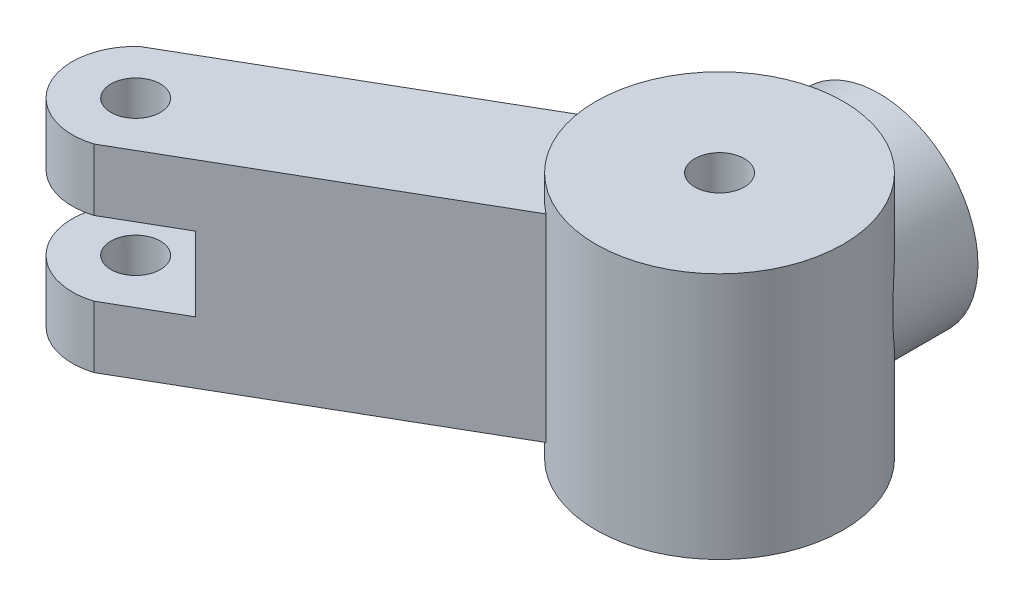
ISO-10303-21;
HEADER;
FILE_DESCRIPTION(('STEP AP214'),'2;1');
FILE_NAME('part.step','',(''),(''),'','','');
FILE_SCHEMA(('AUTOMOTIVE_DESIGN { 1 0 10303 214 1 1 1 1 }'));
ENDSEC;
DATA;
#1=APPLICATION_CONTEXT('core data for automotive mechanical design processes');
#2=APPLICATION_PROTOCOL_DEFINITION('international standard','automotive_design',2000,#1);
#3=PRODUCT_CONTEXT('',#1,'mechanical');
#4=PRODUCT('Part','Part','',(#3));
#5=PRODUCT_RELATED_PRODUCT_CATEGORY('part','',(#4));
#6=PRODUCT_DEFINITION_FORMATION('','',#4);
#7=PRODUCT_DEFINITION_CONTEXT('part definition',#1,'design');
#8=PRODUCT_DEFINITION('design','',#6,#7);
#9=PRODUCT_DEFINITION_SHAPE('','',#8);
#10=(LENGTH_UNIT() NAMED_UNIT(*) SI_UNIT(.MILLI.,.METRE.));
#11=(NAMED_UNIT(*) PLANE_ANGLE_UNIT() SI_UNIT($,.RADIAN.));
#12=(NAMED_UNIT(*) SI_UNIT($,.STERADIAN.) SOLID_ANGLE_UNIT());
#13=UNCERTAINTY_MEASURE_WITH_UNIT(LENGTH_MEASURE(1.E-05),#10,'distance_accuracy_value','');
#14=(GEOMETRIC_REPRESENTATION_CONTEXT(3) GLOBAL_UNCERTAINTY_ASSIGNED_CONTEXT((#13)) GLOBAL_UNIT_ASSIGNED_CONTEXT((#10,
#11,#12)) REPRESENTATION_CONTEXT('',''));
#15=CARTESIAN_POINT('',(0.,0.,0.));
#16=DIRECTION('',(0.,0.,1.));
#17=DIRECTION('',(1.,0.,0.));
#18=AXIS2_PLACEMENT_3D('',#15,#16,#17);
#19=CARTESIAN_POINT('',(-18.8789432215705,3.4417709979174,13.7450624126102));
#20=DIRECTION('',(0.,-1.,0.));
#21=DIRECTION('',(0.,0.,-1.));
#22=AXIS2_PLACEMENT_3D('',#19,#20,#21);
#23=PLANE('',#22);
#24=CARTESIAN_POINT('',(-15.4097531243728,3.4417709979174,14.6288759220713));
#25=DIRECTION('',(0.,1.,0.));
#26=DIRECTION('',(0.,0.,1.));
#27=AXIS2_PLACEMENT_3D('',#24,#25,#26);
#28=CIRCLE('',#27,0.999999999999999);
#29=CARTESIAN_POINT('',(-15.4097531243728,3.4417709979174,15.6288759220713));
#30=VERTEX_POINT('',#29);
#31=EDGE_CURVE('E302',#30,#30,#28,.T.);
#32=ORIENTED_EDGE('',*,*,#31,.F.);
#33=EDGE_LOOP('',(#32));
#34=FACE_BOUND('',#33,.T.);
#35=CARTESIAN_POINT('',(-15.4097531243728,3.4417709979174,14.6288759220713));
#36=DIRECTION('',(0.,1.,0.));
#37=DIRECTION('',(0.,0.,1.));
#38=AXIS2_PLACEMENT_3D('',#35,#36,#37);
#39=CIRCLE('',#38,2.5625);
#40=CARTESIAN_POINT('',(-17.1468924140016,3.4417709979174,12.7450624126102));
#41=VERTEX_POINT('',#40);
#42=CARTESIAN_POINT('',(-14.6468924140016,3.4417709979174,17.0751894315324));
#43=VERTEX_POINT('',#42);
#44=EDGE_CURVE('E128',#41,#43,#39,.T.);
#45=ORIENTED_EDGE('',*,*,#44,.T.);
#46=DIRECTION('',(0.866025403784436,0.,-0.500000000000004));
#47=VECTOR('',#46,1.);
#48=CARTESIAN_POINT('',(-16.3789432215705,3.4417709979174,18.0751894315324));
#49=LINE('',#48,#47);
#50=CARTESIAN_POINT('',(-3.06971510076741,3.4417709979174,10.3911029932806));
#51=VERTEX_POINT('',#50);
#52=EDGE_CURVE('E132',#43,#51,#49,.T.);
#53=ORIENTED_EDGE('',*,*,#52,.T.);
#54=CARTESIAN_POINT('',(0.,3.4417709979174,6.44435126557833));
#55=DIRECTION('',(0.,1.,0.));
#56=DIRECTION('',(0.,0.,1.));
#57=AXIS2_PLACEMENT_3D('',#54,#55,#56);
#58=CIRCLE('',#57,5.);
#59=CARTESIAN_POINT('',(-4.94426439264563,3.4417709979174,5.69987183965941));
#60=VERTEX_POINT('',#59);
#61=EDGE_CURVE('E157',#60,#51,#58,.T.);
#62=ORIENTED_EDGE('',*,*,#61,.F.);
#63=DIRECTION('',(0.866025403784436,0.,-0.500000000000004));
#64=VECTOR('',#63,1.);
#65=CARTESIAN_POINT('',(-18.8789432215705,3.4417709979174,13.7450624126102));
#66=LINE('',#65,#64);
#67=EDGE_CURVE('E133',#41,#60,#66,.T.);
#68=ORIENTED_EDGE('',*,*,#67,.F.);
#69=EDGE_LOOP('',(#45,#53,#62,#68));
#70=FACE_BOUND('',#69,.T.);
#71=ADVANCED_FACE('F59',(#34,#70),#23,.F.);
#72=CARTESIAN_POINT('',(-18.8789432215705,-4.5582290020826,13.7450624126102));
#73=DIRECTION('',(0.,1.,0.));
#74=DIRECTION('',(0.,0.,1.));
#75=AXIS2_PLACEMENT_3D('',#72,#73,#74);
#76=PLANE('',#75);
#77=CARTESIAN_POINT('',(-15.4097531243728,-4.5582290020826,14.6288759220713));
#78=DIRECTION('',(0.,1.,0.));
#79=DIRECTION('',(0.,0.,1.));
#80=AXIS2_PLACEMENT_3D('',#77,#78,#79);
#81=CIRCLE('',#80,0.999999999999999);
#82=CARTESIAN_POINT('',(-15.4097531243728,-4.5582290020826,15.6288759220713));
#83=VERTEX_POINT('',#82);
#84=EDGE_CURVE('E135',#83,#83,#81,.T.);
#85=ORIENTED_EDGE('',*,*,#84,.T.);
#86=EDGE_LOOP('',(#85));
#87=FACE_BOUND('',#86,.T.);
#88=DIRECTION('',(0.866025403784436,0.,-0.500000000000004));
#89=VECTOR('',#88,1.);
#90=CARTESIAN_POINT('',(-16.3789432215705,-4.5582290020826,18.0751894315324));
#91=LINE('',#90,#89);
#92=CARTESIAN_POINT('',(-14.6468924140016,-4.5582290020826,17.0751894315324));
#93=VERTEX_POINT('',#92);
#94=CARTESIAN_POINT('',(-3.06971510076741,-4.5582290020826,10.3911029932806));
#95=VERTEX_POINT('',#94);
#96=EDGE_CURVE('E85',#93,#95,#91,.T.);
#97=ORIENTED_EDGE('',*,*,#96,.F.);
#98=CARTESIAN_POINT('',(-15.4097531243728,-4.5582290020826,14.6288759220713));
#99=DIRECTION('',(0.,1.,0.));
#100=DIRECTION('',(0.,0.,1.));
#101=AXIS2_PLACEMENT_3D('',#98,#99,#100);
#102=CIRCLE('',#101,2.5625);
#103=CARTESIAN_POINT('',(-17.1468924140016,-4.5582290020826,12.7450624126102));
#104=VERTEX_POINT('',#103);
#105=EDGE_CURVE('E286',#104,#93,#102,.T.);
#106=ORIENTED_EDGE('',*,*,#105,.F.);
#107=DIRECTION('',(0.866025403784436,0.,-0.500000000000004));
#108=VECTOR('',#107,1.);
#109=CARTESIAN_POINT('',(-18.8789432215705,-4.5582290020826,13.7450624126102));
#110=LINE('',#109,#108);
#111=CARTESIAN_POINT('',(-4.94426439264563,-4.5582290020826,5.69987183965941));
#112=VERTEX_POINT('',#111);
#113=EDGE_CURVE('E151',#104,#112,#110,.T.);
#114=ORIENTED_EDGE('',*,*,#113,.T.);
#115=CARTESIAN_POINT('',(0.,-4.5582290020826,6.44435126557833));
#116=DIRECTION('',(0.,-1.,0.));
#117=DIRECTION('',(0.,0.,-1.));
#118=AXIS2_PLACEMENT_3D('',#115,#116,#117);
#119=CIRCLE('',#118,5.);
#120=EDGE_CURVE('E154',#95,#112,#119,.T.);
#121=ORIENTED_EDGE('',*,*,#120,.F.);
#122=EDGE_LOOP('',(#97,#106,#114,#121));
#123=FACE_BOUND('',#122,.T.);
#124=ADVANCED_FACE('F217',(#87,#123),#76,.F.);
#125=CARTESIAN_POINT('',(-8.8789432215704,-2.0582290020826,31.065570488299));
#126=DIRECTION('',(0.,-1.,0.));
#127=DIRECTION('',(0.,0.,-1.));
#128=AXIS2_PLACEMENT_3D('',#125,#126,#127);
#129=PLANE('',#128);
#130=CARTESIAN_POINT('',(-15.4097531243728,-2.0582290020826,14.6288759220713));
#131=DIRECTION('',(0.,-1.,0.));
#132=DIRECTION('',(0.,0.,-1.));
#133=AXIS2_PLACEMENT_3D('',#130,#131,#132);
#134=CIRCLE('',#133,0.999999999999999);
#135=CARTESIAN_POINT('',(-15.4097531243728,-2.0582290020826,13.6288759220713));
#136=VERTEX_POINT('',#135);
#137=EDGE_CURVE('E298',#136,#136,#134,.T.);
#138=ORIENTED_EDGE('',*,*,#137,.T.);
#139=EDGE_LOOP('',(#138));
#140=FACE_BOUND('',#139,.T.);
#141=CARTESIAN_POINT('',(-15.4097531243728,-2.0582290020826,14.6288759220713));
#142=DIRECTION('',(0.,-1.,0.));
#143=DIRECTION('',(0.,0.,-1.));
#144=AXIS2_PLACEMENT_3D('',#141,#142,#143);
#145=CIRCLE('',#144,2.5625);
#146=CARTESIAN_POINT('',(-14.6468924140016,-2.0582290020826,17.0751894315324));
#147=VERTEX_POINT('',#146);
#148=CARTESIAN_POINT('',(-17.1468924140016,-2.0582290020826,12.7450624126102));
#149=VERTEX_POINT('',#148);
#150=EDGE_CURVE('E289',#147,#149,#145,.T.);
#151=ORIENTED_EDGE('',*,*,#150,.F.);
#152=DIRECTION('',(-0.866025403784436,0.,0.500000000000004));
#153=VECTOR('',#152,1.);
#154=CARTESIAN_POINT('',(-16.3789432215705,-2.0582290020826,18.0751894315324));
#155=LINE('',#154,#153);
#156=CARTESIAN_POINT('',(-12.0488162026483,-2.0582290020826,15.5751894315324));
#157=VERTEX_POINT('',#156);
#158=EDGE_CURVE('E259',#157,#147,#155,.T.);
#159=ORIENTED_EDGE('',*,*,#158,.F.);
#160=DIRECTION('',(-0.500000000000004,0.,-0.866025403784436));
#161=VECTOR('',#160,1.);
#162=CARTESIAN_POINT('',(-4.54881620264821,-2.0582290020826,28.5655704882989));
#163=LINE('',#162,#161);
#164=CARTESIAN_POINT('',(-14.5488162026483,-2.0582290020826,11.2450624126102));
#165=VERTEX_POINT('',#164);
#166=EDGE_CURVE('E268',#157,#165,#163,.T.);
#167=ORIENTED_EDGE('',*,*,#166,.T.);
#168=DIRECTION('',(-0.866025403784436,0.,0.500000000000004));
#169=VECTOR('',#168,1.);
#170=CARTESIAN_POINT('',(-18.8789432215705,-2.0582290020826,13.7450624126102));
#171=LINE('',#170,#169);
#172=EDGE_CURVE('E273',#165,#149,#171,.T.);
#173=ORIENTED_EDGE('',*,*,#172,.T.);
#174=EDGE_LOOP('',(#151,#159,#167,#173));
#175=FACE_BOUND('',#174,.T.);
#176=ADVANCED_FACE('F223',(#140,#175),#129,.F.);
#177=CARTESIAN_POINT('',(-8.8789432215704,0.941770997917403,31.065570488299));
#178=DIRECTION('',(0.,1.,0.));
#179=DIRECTION('',(0.,0.,1.));
#180=AXIS2_PLACEMENT_3D('',#177,#178,#179);
#181=PLANE('',#180);
#182=CARTESIAN_POINT('',(-15.4097531243728,0.941770997917399,14.6288759220713));
#183=DIRECTION('',(0.,1.,0.));
#184=DIRECTION('',(0.,0.,1.));
#185=AXIS2_PLACEMENT_3D('',#182,#183,#184);
#186=CIRCLE('',#185,0.999999999999999);
#187=CARTESIAN_POINT('',(-15.4097531243728,0.9417709979174,15.6288759220713));
#188=VERTEX_POINT('',#187);
#189=EDGE_CURVE('E64',#188,#188,#186,.T.);
#190=ORIENTED_EDGE('',*,*,#189,.T.);
#191=EDGE_LOOP('',(#190));
#192=FACE_BOUND('',#191,.T.);
#193=DIRECTION('',(0.866025403784436,0.,-0.500000000000004));
#194=VECTOR('',#193,1.);
#195=CARTESIAN_POINT('',(-16.3789432215705,0.9417709979174,18.0751894315324));
#196=LINE('',#195,#194);
#197=CARTESIAN_POINT('',(-14.6468924140016,0.941770997917399,17.0751894315324));
#198=VERTEX_POINT('',#197);
#199=CARTESIAN_POINT('',(-12.0488162026483,0.941770997917399,15.5751894315324));
#200=VERTEX_POINT('',#199);
#201=EDGE_CURVE('E263',#198,#200,#196,.T.);
#202=ORIENTED_EDGE('',*,*,#201,.F.);
#203=CARTESIAN_POINT('',(-15.4097531243728,0.941770997917399,14.6288759220713));
#204=DIRECTION('',(0.,1.,0.));
#205=DIRECTION('',(0.,0.,1.));
#206=AXIS2_PLACEMENT_3D('',#203,#204,#205);
#207=CIRCLE('',#206,2.5625);
#208=CARTESIAN_POINT('',(-17.1468924140016,0.941770997917399,12.7450624126102));
#209=VERTEX_POINT('',#208);
#210=EDGE_CURVE('E139',#209,#198,#207,.T.);
#211=ORIENTED_EDGE('',*,*,#210,.F.);
#212=DIRECTION('',(0.866025403784436,0.,-0.500000000000004));
#213=VECTOR('',#212,1.);
#214=CARTESIAN_POINT('',(-18.8789432215705,0.941770997917399,13.7450624126102));
#215=LINE('',#214,#213);
#216=CARTESIAN_POINT('',(-14.5488162026483,0.941770997917398,11.2450624126102));
#217=VERTEX_POINT('',#216);
#218=EDGE_CURVE('E283',#209,#217,#215,.T.);
#219=ORIENTED_EDGE('',*,*,#218,.T.);
#220=DIRECTION('',(-0.500000000000004,0.,-0.866025403784436));
#221=VECTOR('',#220,1.);
#222=CARTESIAN_POINT('',(-4.54881620264821,0.941770997917402,28.5655704882989));
#223=LINE('',#222,#221);
#224=EDGE_CURVE('E269',#200,#217,#223,.T.);
#225=ORIENTED_EDGE('',*,*,#224,.F.);
#226=EDGE_LOOP('',(#202,#211,#219,#225));
#227=FACE_BOUND('',#226,.T.);
#228=ADVANCED_FACE('F310',(#192,#227),#181,.F.);
#229=CARTESIAN_POINT('',(-16.3789432215705,3.4417709979174,18.0751894315324));
#230=DIRECTION('',(-0.500000000000004,0.,-0.866025403784436));
#231=DIRECTION('',(-0.866025403784436,0.,0.500000000000004));
#232=AXIS2_PLACEMENT_3D('',#229,#230,#231);
#233=PLANE('',#232);
#234=DIRECTION('',(0.,1.,0.));
#235=VECTOR('',#234,1.);
#236=CARTESIAN_POINT('',(-14.6468924140016,-16.5582290020826,17.0751894315324));
#237=LINE('',#236,#235);
#238=EDGE_CURVE('E12',#93,#147,#237,.T.);
#239=ORIENTED_EDGE('',*,*,#238,.F.);
#240=ORIENTED_EDGE('',*,*,#96,.T.);
#241=DIRECTION('',(0.,1.,0.));
#242=VECTOR('',#241,1.);
#243=CARTESIAN_POINT('',(-3.06971510076741,-5.5582290020826,10.3911029932806));
#244=LINE('',#243,#242);
#245=EDGE_CURVE('E144',#51,#95,#244,.F.);
#246=ORIENTED_EDGE('',*,*,#245,.F.);
#247=ORIENTED_EDGE('',*,*,#52,.F.);
#248=EDGE_CURVE('E70',#198,#43,#237,.T.);
#249=ORIENTED_EDGE('',*,*,#248,.F.);
#250=ORIENTED_EDGE('',*,*,#201,.T.);
#251=DIRECTION('',(0.,-1.,0.));
#252=VECTOR('',#251,1.);
#253=CARTESIAN_POINT('',(-12.0488162026483,3.4417709979174,15.5751894315324));
#254=LINE('',#253,#252);
#255=EDGE_CURVE('E458',#200,#157,#254,.T.);
#256=ORIENTED_EDGE('',*,*,#255,.T.);
#257=ORIENTED_EDGE('',*,*,#158,.T.);
#258=EDGE_LOOP('',(#239,#240,#246,#247,#249,#250,#256,#257));
#259=FACE_BOUND('',#258,.T.);
#260=ADVANCED_FACE('F142',(#259),#233,.F.);
#261=CARTESIAN_POINT('',(-18.8789432215705,3.4417709979174,13.7450624126102));
#262=DIRECTION('',(0.500000000000004,0.,0.866025403784436));
#263=DIRECTION('',(0.866025403784436,0.,-0.500000000000004));
#264=AXIS2_PLACEMENT_3D('',#261,#262,#263);
#265=PLANE('',#264);
#266=DIRECTION('',(0.,1.,0.));
#267=VECTOR('',#266,1.);
#268=CARTESIAN_POINT('',(-17.1468924140016,-16.5582290020826,12.7450624126102));
#269=LINE('',#268,#267);
#270=EDGE_CURVE('E77',#209,#41,#269,.T.);
#271=ORIENTED_EDGE('',*,*,#270,.T.);
#272=ORIENTED_EDGE('',*,*,#67,.T.);
#273=DIRECTION('',(0.,1.,0.));
#274=VECTOR('',#273,1.);
#275=CARTESIAN_POINT('',(-4.94426439264563,-5.5582290020826,5.69987183965941));
#276=LINE('',#275,#274);
#277=EDGE_CURVE('E147',#112,#60,#276,.T.);
#278=ORIENTED_EDGE('',*,*,#277,.F.);
#279=ORIENTED_EDGE('',*,*,#113,.F.);
#280=EDGE_CURVE('E292',#104,#149,#269,.T.);
#281=ORIENTED_EDGE('',*,*,#280,.T.);
#282=ORIENTED_EDGE('',*,*,#172,.F.);
#283=DIRECTION('',(0.,-1.,0.));
#284=VECTOR('',#283,1.);
#285=CARTESIAN_POINT('',(-14.5488162026483,0.941770997917398,11.2450624126102));
#286=LINE('',#285,#284);
#287=EDGE_CURVE('E279',#217,#165,#286,.T.);
#288=ORIENTED_EDGE('',*,*,#287,.F.);
#289=ORIENTED_EDGE('',*,*,#218,.F.);
#290=EDGE_LOOP('',(#271,#272,#278,#279,#281,#282,#288,#289));
#291=FACE_BOUND('',#290,.T.);
#292=ADVANCED_FACE('F200',(#291),#265,.F.);
#293=CARTESIAN_POINT('',(0.,-5.5582290020826,6.44435126557833));
#294=DIRECTION('',(0.,1.,0.));
#295=DIRECTION('',(0.,0.,1.));
#296=AXIS2_PLACEMENT_3D('',#293,#294,#295);
#297=CYLINDRICAL_SURFACE('',#296,5.);
#298=CARTESIAN_POINT('',(0.,4.4417709979174,6.44435126557833));
#299=DIRECTION('',(0.,1.,0.));
#300=DIRECTION('',(0.,0.,1.));
#301=AXIS2_PLACEMENT_3D('',#298,#299,#300);
#302=CIRCLE('',#301,5.);
#303=CARTESIAN_POINT('',(0.,4.4417709979174,11.4443512655783));
#304=VERTEX_POINT('',#303);
#305=EDGE_CURVE('E176',#304,#304,#302,.T.);
#306=ORIENTED_EDGE('',*,*,#305,.F.);
#307=EDGE_LOOP('',(#306));
#308=FACE_BOUND('',#307,.T.);
#309=CARTESIAN_POINT('',(0.,-5.5582290020826,6.44435126557833));
#310=DIRECTION('',(0.,1.,0.));
#311=DIRECTION('',(0.,0.,1.));
#312=AXIS2_PLACEMENT_3D('',#309,#310,#311);
#313=CIRCLE('',#312,5.);
#314=CARTESIAN_POINT('',(0.,-5.5582290020826,11.4443512655783));
#315=VERTEX_POINT('',#314);
#316=EDGE_CURVE('E177',#315,#315,#313,.T.);
#317=ORIENTED_EDGE('',*,*,#316,.T.);
#318=EDGE_LOOP('',(#317));
#319=FACE_BOUND('',#318,.T.);
#320=CARTESIAN_POINT('',(-4.,0.,3.44435126557833));
#321=CARTESIAN_POINT('',(-3.99999906153736,0.0751127638724344,3.44434909660127));
#322=CARTESIAN_POINT('',(-3.9978772461753,0.150254878305163,3.44151354457883));
#323=CARTESIAN_POINT('',(-3.9894472679785,0.2999085668623,3.43032542579266));
#324=CARTESIAN_POINT('',(-3.98313625047582,0.374419675908661,3.42196909699804));
#325=CARTESIAN_POINT('',(-3.95807727295162,0.596479266938773,3.38912204637001));
#326=CARTESIAN_POINT('',(-3.93320424396426,0.742244109025282,3.35685574728303));
#327=CARTESIAN_POINT('',(-3.85777127536566,1.0752679296061,3.26279910253566));
#328=CARTESIAN_POINT('',(-3.80127986277752,1.25928076292897,3.19463804540698));
#329=CARTESIAN_POINT('',(-3.66572012951488,1.61194054365924,3.04245482027077));
#330=CARTESIAN_POINT('',(-3.58658817896458,1.78054239204038,2.9583881793468));
#331=CARTESIAN_POINT('',(-3.43637278534429,2.05110258051125,2.81135671047808));
#332=CARTESIAN_POINT('',(-3.37076459378184,2.15717257294231,2.75020758210033));
#333=CARTESIAN_POINT('',(-3.23028207033377,2.3623609148689,2.62675860248482));
#334=CARTESIAN_POINT('',(-3.15540441260616,2.4614767491437,2.56445834508772));
#335=CARTESIAN_POINT('',(-2.99663184861433,2.65246985516929,2.4405616808686));
#336=CARTESIAN_POINT('',(-2.91274636380755,2.74435451909374,2.37896461177275));
#337=CARTESIAN_POINT('',(-2.73598294461541,2.92061301851081,2.25795888667943));
#338=CARTESIAN_POINT('',(-2.64310382389854,3.00498586030965,2.19855052081986));
#339=CARTESIAN_POINT('',(-2.38958702931892,3.21416413454218,2.04858628741155));
#340=CARTESIAN_POINT('',(-2.22188522507707,3.33264039959268,1.96087056226542));
#341=CARTESIAN_POINT('',(-1.86487183658862,3.54474406665983,1.80103532288292));
#342=CARTESIAN_POINT('',(-1.67559449748563,3.63841008366884,1.72889160496097));
#343=CARTESIAN_POINT('',(-1.31063780833639,3.7834234169018,1.61604102960865));
#344=CARTESIAN_POINT('',(-1.13770814774396,3.83916445823781,1.57213725584211));
#345=CARTESIAN_POINT('',(-0.782375130146822,3.92699806105482,1.50263230817722));
#346=CARTESIAN_POINT('',(-0.599977012805123,3.95910355575582,1.4770211249193));
#347=CARTESIAN_POINT('',(-0.230096932996535,3.99771600602419,1.44619207954371));
#348=CARTESIAN_POINT('',(-0.042599613013427,4.00413433708609,1.44104482139075));
#349=CARTESIAN_POINT('',(0.330832803126791,3.99067157854909,1.45181249142555));
#350=CARTESIAN_POINT('',(0.516767826586743,3.97078927186836,1.46772839432698));
#351=CARTESIAN_POINT('',(0.871367119528875,3.90786401545558,1.51778396395924));
#352=CARTESIAN_POINT('',(1.04042037317327,3.86614236288635,1.55088317183519));
#353=CARTESIAN_POINT('',(1.36834372900709,3.76260953469807,1.63226138896516));
#354=CARTESIAN_POINT('',(1.5272112495601,3.70079328989184,1.6805442284365));
#355=CARTESIAN_POINT('',(1.84705463504236,3.55279860185086,1.79462682668393));
#356=CARTESIAN_POINT('',(2.00675938549037,3.46484696774349,1.86166595265332));
#357=CARTESIAN_POINT('',(2.30941782762205,3.27092428104424,2.00647039236821));
#358=CARTESIAN_POINT('',(2.4523620660043,3.16494314121064,2.08424170598919));
#359=CARTESIAN_POINT('',(2.74853042703121,2.91387626247909,2.2632810460683));
#360=CARTESIAN_POINT('',(2.89780217491636,2.76523277225894,2.36608837978198));
#361=CARTESIAN_POINT('',(3.17076769972647,2.44748819202968,2.57450370705273));
#362=CARTESIAN_POINT('',(3.29442988804259,2.27836224005015,2.68011498024652));
#363=CARTESIAN_POINT('',(3.50457057042853,1.9375596107156,2.87552491300381));
#364=CARTESIAN_POINT('',(3.59348348213152,1.76769812737777,2.96586677431946));
#365=CARTESIAN_POINT('',(3.74778213755155,1.41126705894499,3.13270915029634));
#366=CARTESIAN_POINT('',(3.81321930924474,1.22473512815756,3.20923973592748));
#367=CARTESIAN_POINT('',(3.90124400044661,0.894416813681411,3.31647516223546));
#368=CARTESIAN_POINT('',(3.93080589266452,0.754774407918023,3.3540392249407));
#369=CARTESIAN_POINT('',(3.97493954411982,0.469639518533787,3.41100517348144));
#370=CARTESIAN_POINT('',(3.98954472407251,0.324160835898653,3.43044754339019));
#371=CARTESIAN_POINT('',(4.00259995644497,0.0302735019019219,3.44779545404848));
#372=CARTESIAN_POINT('',(4.00095637919488,-0.118147206476347,3.44557617553769));
#373=CARTESIAN_POINT('',(3.98145195095297,-0.41209561507503,3.41974216302214));
#374=CARTESIAN_POINT('',(3.96356821696024,-0.557618937011222,3.39609723956685));
#375=CARTESIAN_POINT('',(3.90662980025043,-0.878121884225113,3.32332099783093));
#376=CARTESIAN_POINT('',(3.86334682887901,-1.05117767007011,3.26923642218505));
#377=CARTESIAN_POINT('',(3.7568227830305,-1.38460065498101,3.14389549369122));
#378=CARTESIAN_POINT('',(3.69352220593005,-1.54492821833796,3.07258809699724));
#379=CARTESIAN_POINT('',(3.56873529200274,-1.81092552210887,2.94149547056785));
#380=CARTESIAN_POINT('',(3.5113936535288,-1.91964530364436,2.88381418770618));
#381=CARTESIAN_POINT('',(3.38766369294499,-2.13041737979329,2.76589616658677));
#382=CARTESIAN_POINT('',(3.32127165613201,-2.23246691104777,2.70565838605196));
#383=CARTESIAN_POINT('',(3.17963685728911,-2.42995611875223,2.58447924613133));
#384=CARTESIAN_POINT('',(3.10438543197557,-2.52538917788069,2.52353725151165));
#385=CARTESIAN_POINT('',(2.9452042144371,-2.70934721579986,2.40259878942025));
#386=CARTESIAN_POINT('',(2.86127578119157,-2.79787327255512,2.34260217557559));
#387=CARTESIAN_POINT('',(2.68353213742299,-2.96885093952303,2.22413499477331));
#388=CARTESIAN_POINT('',(2.5895923964421,-3.05119722338575,2.16569865430047));
#389=CARTESIAN_POINT('',(2.39294409088258,-3.2077427948928,2.0526907248345));
#390=CARTESIAN_POINT('',(2.2902341584402,-3.28194080753191,1.99811974114812));
#391=CARTESIAN_POINT('',(2.07659269983668,-3.4211050204968,1.89442675812455));
#392=CARTESIAN_POINT('',(1.96568453999992,-3.48609602729697,1.84529019837803));
#393=CARTESIAN_POINT('',(1.73599312724424,-3.60598282457441,1.75376312318856));
#394=CARTESIAN_POINT('',(1.61721438534433,-3.66088433090296,1.71136879001848));
#395=CARTESIAN_POINT('',(1.3291396214626,-3.77693416615782,1.62113070050375));
#396=CARTESIAN_POINT('',(1.15683679137342,-3.83342216125891,1.5766642655089));
#397=CARTESIAN_POINT('',(0.802710516835257,-3.92287685298778,1.50590883556101));
#398=CARTESIAN_POINT('',(0.620894454329601,-3.95586150517093,1.4796059648919));
#399=CARTESIAN_POINT('',(0.251928169863229,-3.99638225985936,1.44726034661185));
#400=CARTESIAN_POINT('',(0.0647609739930231,-4.00382550672547,1.44129152388721));
#401=CARTESIAN_POINT('',(-0.308260451752376,-3.99246788492419,1.45037604656148));
#402=CARTESIAN_POINT('',(-0.494114588250193,-3.97366516830221,1.46543087221652));
#403=CARTESIAN_POINT('',(-0.848969594728795,-3.91279269274,1.51387128750524));
#404=CARTESIAN_POINT('',(-1.01834018003764,-3.87202131706675,1.54623326538194));
#405=CARTESIAN_POINT('',(-1.34704122291858,-3.7702931775047,1.62624722039187));
#406=CARTESIAN_POINT('',(-1.50636906741201,-3.70933118569921,1.67390315746075));
#407=CARTESIAN_POINT('',(-1.82676698607757,-3.56325105620565,1.7866270195319));
#408=CARTESIAN_POINT('',(-1.98661951413851,-3.47641294678162,1.85290255699066));
#409=CARTESIAN_POINT('',(-2.28972858505141,-3.2847146944691,1.99628411434302));
#410=CARTESIAN_POINT('',(-2.43297624848929,-3.17984498297378,2.07339588057375));
#411=CARTESIAN_POINT('',(-2.72976152486729,-2.931410442207,2.2510107299744));
#412=CARTESIAN_POINT('',(-2.87940400752524,-2.78431890412568,2.35307102265676));
#413=CARTESIAN_POINT('',(-3.15339914395293,-2.46975440470847,2.56033928772213));
#414=CARTESIAN_POINT('',(-3.2777199709751,-2.30225621151788,2.66555103305404));
#415=CARTESIAN_POINT('',(-3.43993958125245,-2.0435346368876,2.81507144492566));
#416=CARTESIAN_POINT('',(-3.488247591851,-1.95998002989854,2.86158062066742));
#417=CARTESIAN_POINT('',(-3.57912761543908,-1.78864740992603,2.95236342100218));
#418=CARTESIAN_POINT('',(-3.62169886134499,-1.70086883426575,2.9966367461376));
#419=CARTESIAN_POINT('',(-3.74029659813686,-1.43132131592965,3.12418144687796));
#420=CARTESIAN_POINT('',(-3.80747088284747,-1.24292483286531,3.2024303366319));
#421=CARTESIAN_POINT('',(-3.89828691275497,-0.907661938318763,3.31274675389221));
#422=CARTESIAN_POINT('',(-3.92892882070587,-0.765010533050364,3.35162810710897));
#423=CARTESIAN_POINT('',(-3.96316402261262,-0.546591673809192,3.39580030864617));
#424=CARTESIAN_POINT('',(-3.97261660358216,-0.473140100329861,3.40815939165844));
#425=CARTESIAN_POINT('',(-3.98745340408318,-0.325161528904423,3.42766898964234));
#426=CARTESIAN_POINT('',(-3.99284047225642,-0.250635321321831,3.43482315149484));
#427=CARTESIAN_POINT('',(-3.99741959341137,-0.146618179321962,3.44091333212136));
#428=CARTESIAN_POINT('',(-3.99838660813179,-0.11732119338124,3.44220107203021));
#429=CARTESIAN_POINT('',(-3.99967703663994,-0.0586843015536533,3.44392051816525));
#430=CARTESIAN_POINT('',(-4.00000036663029,-0.0293443905761246,3.44435211293512));
#431=CARTESIAN_POINT('',(-4.,0.,3.44435126557833));
#432=B_SPLINE_CURVE_WITH_KNOTS('',3,(#320,#321,#322,#323,#324,#325,#326,#327,#328,#329,#330,
#331,#332,#333,#334,#335,#336,#337,#338,#339,#340,#341,#342,#343,#344,#345,#346,#347,#348,#349,
#350,#351,#352,#353,#354,#355,#356,#357,#358,#359,#360,#361,#362,#363,#364,#365,#366,#367,#368,
#369,#370,#371,#372,#373,#374,#375,#376,#377,#378,#379,#380,#381,#382,#383,#384,#385,#386,#387,
#388,#389,#390,#391,#392,#393,#394,#395,#396,#397,#398,#399,#400,#401,#402,#403,#404,#405,#406,
#407,#408,#409,#410,#411,#412,#413,#414,#415,#416,#417,#418,#419,#420,#421,#422,#423,#424,#425,
#426,#427,#428,#429,#430,#431),.UNSPECIFIED.,.T.,.F.,(4,2,2,2,2,2,2,2,2,2,2,2,2,2,2,2,2,2,2,2,2,
2,2,2,2,2,2,2,2,2,2,2,2,2,2,2,2,2,2,2,2,2,2,2,2,2,2,2,2,2,2,2,2,2,2,4),(0.,0.225303149807231,
0.450759986838273,0.902589537001555,1.51190711853316,2.12295426111056,2.53921883623537,
2.95563320042537,3.37161619465101,3.78765413525725,4.45477512810167,5.12085162154028,
5.67923095322338,6.23730451573862,6.79730186307842,7.35732512562407,7.88682741454582,
8.41646338281239,8.99711927828841,9.57810111704287,10.2788135954479,10.9803852999411,
11.6143729322192,12.2469630912607,12.6881435902171,13.1283361077291,13.5710666035102,
14.0144218930567,14.5705602720657,15.1283675704704,15.5352238321967,15.942247592246,
16.3496727250838,16.7570341440244,17.1702378198689,17.5835060601354,17.9956387441516,
18.4075372242805,18.9651425713466,19.5223214735685,20.0815238628587,20.6407656270703,
21.1700928587455,21.6995572553744,22.2782911959238,22.8573331992423,23.5548944002191,
24.2533270266164,24.5745079263911,24.8957317299052,25.5365329660934,25.9876445768306,
26.2126360623764,26.4374697531347,26.5254777394982,26.6134971823349),.UNSPECIFIED.);
#433=CARTESIAN_POINT('',(-4.,0.,3.44435126557833));
#434=VERTEX_POINT('',#433);
#435=EDGE_CURVE('E181',#434,#434,#432,.T.);
#436=ORIENTED_EDGE('',*,*,#435,.F.);
#437=EDGE_LOOP('',(#436));
#438=FACE_BOUND('',#437,.T.);
#439=ORIENTED_EDGE('',*,*,#277,.T.);
#440=ORIENTED_EDGE('',*,*,#61,.T.);
#441=ORIENTED_EDGE('',*,*,#245,.T.);
#442=ORIENTED_EDGE('',*,*,#120,.T.);
#443=EDGE_LOOP('',(#439,#440,#441,#442));
#444=FACE_BOUND('',#443,.T.);
#445=ADVANCED_FACE('F194',(#308,#319,#438,#444),#297,.T.);
#446=CARTESIAN_POINT('',(0.,0.,0.));
#447=DIRECTION('',(0.,0.,1.));
#448=DIRECTION('',(1.,0.,0.));
#449=AXIS2_PLACEMENT_3D('',#446,#447,#448);
#450=PLANE('',#449);
#451=CARTESIAN_POINT('',(0.,0.,0.));
#452=DIRECTION('',(0.,0.,1.));
#453=DIRECTION('',(1.,0.,0.));
#454=AXIS2_PLACEMENT_3D('',#451,#452,#453);
#455=CIRCLE('',#454,4.);
#456=CARTESIAN_POINT('',(4.,0.,0.));
#457=VERTEX_POINT('',#456);
#458=EDGE_CURVE('E461',#457,#457,#455,.T.);
#459=ORIENTED_EDGE('',*,*,#458,.F.);
#460=EDGE_LOOP('',(#459));
#461=FACE_BOUND('',#460,.T.);
#462=CARTESIAN_POINT('',(0.,0.,0.));
#463=DIRECTION('',(0.,0.,1.));
#464=DIRECTION('',(1.,0.,0.));
#465=AXIS2_PLACEMENT_3D('',#462,#463,#464);
#466=CIRCLE('',#465,2.5);
#467=CARTESIAN_POINT('',(2.5,0.,0.));
#468=VERTEX_POINT('',#467);
#469=EDGE_CURVE('E192',#468,#468,#466,.T.);
#470=ORIENTED_EDGE('',*,*,#469,.T.);
#471=EDGE_LOOP('',(#470));
#472=FACE_BOUND('',#471,.T.);
#473=ADVANCED_FACE('F199',(#461,#472),#450,.F.);
#474=CARTESIAN_POINT('',(0.,0.,4.));
#475=DIRECTION('',(0.,0.,-1.));
#476=DIRECTION('',(-1.,0.,0.));
#477=AXIS2_PLACEMENT_3D('',#474,#475,#476);
#478=CYLINDRICAL_SURFACE('',#477,4.);
#479=ORIENTED_EDGE('',*,*,#435,.T.);
#480=EDGE_LOOP('',(#479));
#481=FACE_BOUND('',#480,.T.);
#482=ORIENTED_EDGE('',*,*,#458,.T.);
#483=EDGE_LOOP('',(#482));
#484=FACE_BOUND('',#483,.T.);
#485=ADVANCED_FACE('F61',(#481,#484),#478,.T.);
#486=CARTESIAN_POINT('',(0.,0.,4.));
#487=DIRECTION('',(0.,0.,-1.));
#488=DIRECTION('',(-1.,0.,0.));
#489=AXIS2_PLACEMENT_3D('',#486,#487,#488);
#490=CYLINDRICAL_SURFACE('',#489,2.5);
#491=ORIENTED_EDGE('',*,*,#469,.F.);
#492=EDGE_LOOP('',(#491));
#493=FACE_BOUND('',#492,.T.);
#494=CARTESIAN_POINT('',(0.,0.,5.));
#495=DIRECTION('',(0.,0.,1.));
#496=DIRECTION('',(1.,0.,0.));
#497=AXIS2_PLACEMENT_3D('',#494,#495,#496);
#498=CIRCLE('',#497,2.5);
#499=CARTESIAN_POINT('',(2.5,0.,5.));
#500=VERTEX_POINT('',#499);
#501=EDGE_CURVE('E169',#500,#500,#498,.T.);
#502=ORIENTED_EDGE('',*,*,#501,.T.);
#503=EDGE_LOOP('',(#502));
#504=FACE_BOUND('',#503,.T.);
#505=ADVANCED_FACE('F204',(#493,#504),#490,.F.);
#506=CARTESIAN_POINT('',(0.,-5.5582290020826,6.44435126557833));
#507=DIRECTION('',(0.,1.,0.));
#508=DIRECTION('',(0.,0.,1.));
#509=AXIS2_PLACEMENT_3D('',#506,#507,#508);
#510=PLANE('',#509);
#511=CARTESIAN_POINT('',(0.,-5.5582290020826,6.44435126557833));
#512=DIRECTION('',(0.,1.,0.));
#513=DIRECTION('',(0.,0.,1.));
#514=AXIS2_PLACEMENT_3D('',#511,#512,#513);
#515=CIRCLE('',#514,1.);
#516=CARTESIAN_POINT('',(0.,-5.5582290020826,7.44435126557833));
#517=VERTEX_POINT('',#516);
#518=EDGE_CURVE('E165',#517,#517,#515,.T.);
#519=ORIENTED_EDGE('',*,*,#518,.T.);
#520=EDGE_LOOP('',(#519));
#521=FACE_BOUND('',#520,.T.);
#522=ORIENTED_EDGE('',*,*,#316,.F.);
#523=EDGE_LOOP('',(#522));
#524=FACE_BOUND('',#523,.T.);
#525=ADVANCED_FACE('F206',(#521,#524),#510,.F.);
#526=CARTESIAN_POINT('',(0.,4.4417709979174,6.44435126557833));
#527=DIRECTION('',(0.,1.,0.));
#528=DIRECTION('',(0.,0.,1.));
#529=AXIS2_PLACEMENT_3D('',#526,#527,#528);
#530=PLANE('',#529);
#531=CARTESIAN_POINT('',(0.,4.4417709979174,6.44435126557833));
#532=DIRECTION('',(0.,1.,0.));
#533=DIRECTION('',(0.,0.,1.));
#534=AXIS2_PLACEMENT_3D('',#531,#532,#533);
#535=CIRCLE('',#534,1.);
#536=CARTESIAN_POINT('',(0.,4.4417709979174,7.44435126557833));
#537=VERTEX_POINT('',#536);
#538=EDGE_CURVE('E164',#537,#537,#535,.T.);
#539=ORIENTED_EDGE('',*,*,#538,.F.);
#540=EDGE_LOOP('',(#539));
#541=FACE_BOUND('',#540,.T.);
#542=ORIENTED_EDGE('',*,*,#305,.T.);
#543=EDGE_LOOP('',(#542));
#544=FACE_BOUND('',#543,.T.);
#545=ADVANCED_FACE('F202',(#541,#544),#530,.T.);
#546=CARTESIAN_POINT('',(0.,0.,5.));
#547=DIRECTION('',(0.,0.,1.));
#548=DIRECTION('',(1.,0.,0.));
#549=AXIS2_PLACEMENT_3D('',#546,#547,#548);
#550=PLANE('',#549);
#551=ORIENTED_EDGE('',*,*,#501,.F.);
#552=EDGE_LOOP('',(#551));
#553=FACE_BOUND('',#552,.T.);
#554=ADVANCED_FACE('F233',(#553),#550,.F.);
#555=CARTESIAN_POINT('',(0.,-5.5582290020826,6.44435126557833));
#556=DIRECTION('',(0.,1.,0.));
#557=DIRECTION('',(0.,0.,1.));
#558=AXIS2_PLACEMENT_3D('',#555,#556,#557);
#559=CYLINDRICAL_SURFACE('',#558,1.);
#560=ORIENTED_EDGE('',*,*,#518,.F.);
#561=EDGE_LOOP('',(#560));
#562=FACE_BOUND('',#561,.T.);
#563=ORIENTED_EDGE('',*,*,#538,.T.);
#564=EDGE_LOOP('',(#563));
#565=FACE_BOUND('',#564,.T.);
#566=ADVANCED_FACE('F229',(#562,#565),#559,.F.);
#567=CARTESIAN_POINT('',(-4.54881620264821,0.941770997917402,28.5655704882989));
#568=DIRECTION('',(0.866025403784436,0.,-0.500000000000004));
#569=DIRECTION('',(-0.500000000000004,0.,-0.866025403784436));
#570=AXIS2_PLACEMENT_3D('',#567,#568,#569);
#571=PLANE('',#570);
#572=ORIENTED_EDGE('',*,*,#224,.T.);
#573=ORIENTED_EDGE('',*,*,#287,.T.);
#574=ORIENTED_EDGE('',*,*,#166,.F.);
#575=ORIENTED_EDGE('',*,*,#255,.F.);
#576=EDGE_LOOP('',(#572,#573,#574,#575));
#577=FACE_BOUND('',#576,.T.);
#578=ADVANCED_FACE('F232',(#577),#571,.F.);
#579=CARTESIAN_POINT('',(-15.4097531243728,-16.5582290020826,14.6288759220713));
#580=DIRECTION('',(0.,1.,0.));
#581=DIRECTION('',(0.,0.,1.));
#582=AXIS2_PLACEMENT_3D('',#579,#580,#581);
#583=CYLINDRICAL_SURFACE('',#582,2.5625);
#584=ORIENTED_EDGE('',*,*,#210,.T.);
#585=ORIENTED_EDGE('',*,*,#248,.T.);
#586=ORIENTED_EDGE('',*,*,#44,.F.);
#587=ORIENTED_EDGE('',*,*,#270,.F.);
#588=EDGE_LOOP('',(#584,#585,#586,#587));
#589=FACE_BOUND('',#588,.T.);
#590=ADVANCED_FACE('F138',(#589),#583,.T.);
#591=ORIENTED_EDGE('',*,*,#105,.T.);
#592=ORIENTED_EDGE('',*,*,#238,.T.);
#593=ORIENTED_EDGE('',*,*,#150,.T.);
#594=ORIENTED_EDGE('',*,*,#280,.F.);
#595=EDGE_LOOP('',(#591,#592,#593,#594));
#596=FACE_BOUND('',#595,.T.);
#597=ADVANCED_FACE('F316',(#596),#583,.T.);
#598=CARTESIAN_POINT('',(-15.4097531243728,-16.5582290020826,14.6288759220713));
#599=DIRECTION('',(0.,1.,0.));
#600=DIRECTION('',(0.,0.,1.));
#601=AXIS2_PLACEMENT_3D('',#598,#599,#600);
#602=CYLINDRICAL_SURFACE('',#601,0.999999999999999);
#603=ORIENTED_EDGE('',*,*,#31,.T.);
#604=EDGE_LOOP('',(#603));
#605=FACE_BOUND('',#604,.T.);
#606=ORIENTED_EDGE('',*,*,#189,.F.);
#607=EDGE_LOOP('',(#606));
#608=FACE_BOUND('',#607,.T.);
#609=ADVANCED_FACE('F313',(#605,#608),#602,.F.);
#610=ORIENTED_EDGE('',*,*,#137,.F.);
#611=EDGE_LOOP('',(#610));
#612=FACE_BOUND('',#611,.T.);
#613=ORIENTED_EDGE('',*,*,#84,.F.);
#614=EDGE_LOOP('',(#613));
#615=FACE_BOUND('',#614,.T.);
#616=ADVANCED_FACE('F315',(#612,#615),#602,.F.);
#617=CLOSED_SHELL('',(#71,#124,#176,#228,#260,#292,#445,#473,#485,#505,#525,#545,#554,#566,#578,
#590,#597,#609,#616));
#618=MANIFOLD_SOLID_BREP('B2',#617);
#619=ADVANCED_BREP_SHAPE_REPRESENTATION('',(#18,#618),#14);
#620=SHAPE_DEFINITION_REPRESENTATION(#9,#619);
ENDSEC;
END-ISO-10303-21;
